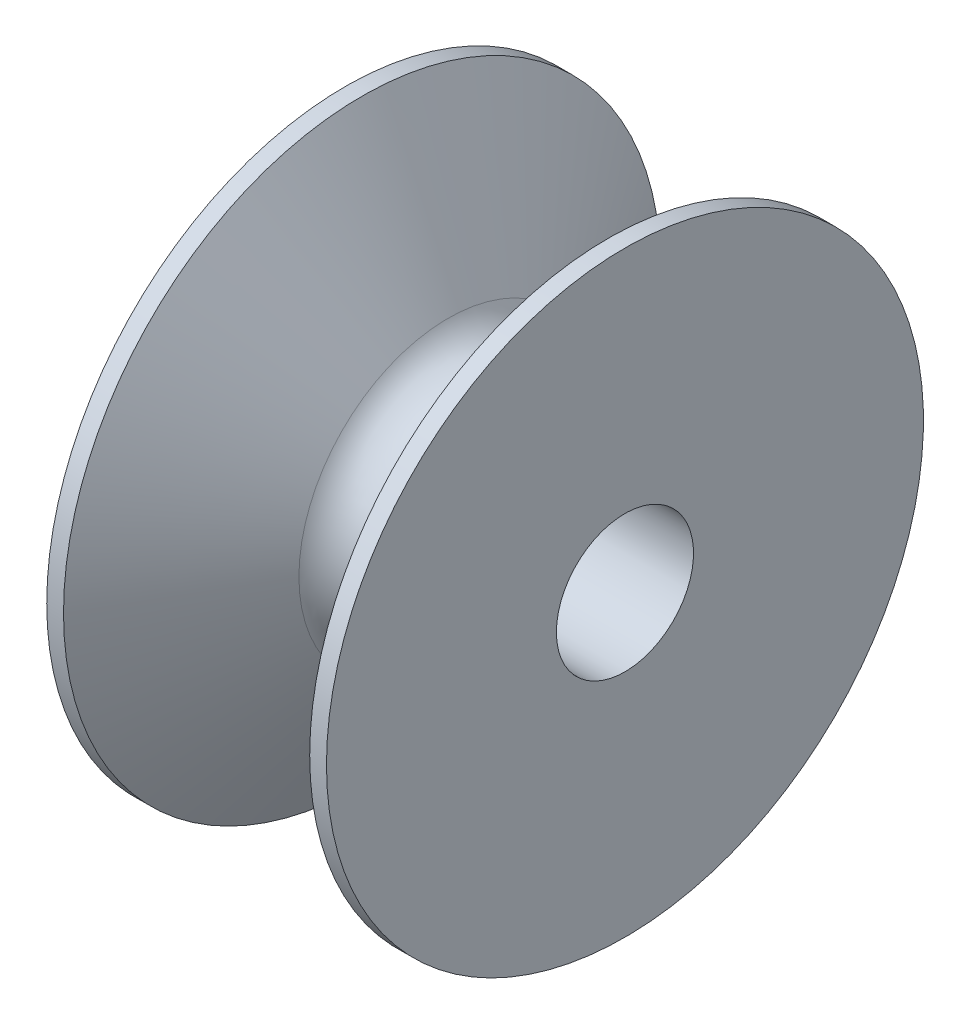
ISO-10303-21;
HEADER;
FILE_DESCRIPTION(('STEP AP214'),'2;1');
FILE_NAME('part.step','',(''),(''),'','','');
FILE_SCHEMA(('AUTOMOTIVE_DESIGN { 1 0 10303 214 1 1 1 1 }'));
ENDSEC;
DATA;
#1=APPLICATION_CONTEXT('core data for automotive mechanical design processes');
#2=APPLICATION_PROTOCOL_DEFINITION('international standard','automotive_design',2000,#1);
#3=PRODUCT_CONTEXT('',#1,'mechanical');
#4=PRODUCT('Part','Part','',(#3));
#5=PRODUCT_RELATED_PRODUCT_CATEGORY('part','',(#4));
#6=PRODUCT_DEFINITION_FORMATION('','',#4);
#7=PRODUCT_DEFINITION_CONTEXT('part definition',#1,'design');
#8=PRODUCT_DEFINITION('design','',#6,#7);
#9=PRODUCT_DEFINITION_SHAPE('','',#8);
#10=(LENGTH_UNIT() NAMED_UNIT(*) SI_UNIT(.MILLI.,.METRE.));
#11=(NAMED_UNIT(*) PLANE_ANGLE_UNIT() SI_UNIT($,.RADIAN.));
#12=(NAMED_UNIT(*) SI_UNIT($,.STERADIAN.) SOLID_ANGLE_UNIT());
#13=UNCERTAINTY_MEASURE_WITH_UNIT(LENGTH_MEASURE(1.E-05),#10,'distance_accuracy_value','');
#14=(GEOMETRIC_REPRESENTATION_CONTEXT(3) GLOBAL_UNCERTAINTY_ASSIGNED_CONTEXT((#13)) GLOBAL_UNIT_ASSIGNED_CONTEXT((#10,
#11,#12)) REPRESENTATION_CONTEXT('',''));
#15=CARTESIAN_POINT('',(0.,0.,0.));
#16=DIRECTION('',(0.,0.,1.));
#17=DIRECTION('',(1.,0.,0.));
#18=AXIS2_PLACEMENT_3D('',#15,#16,#17);
#19=CARTESIAN_POINT('',(0.,11.1125,0.));
#20=DIRECTION('',(1.,0.,0.));
#21=DIRECTION('',(0.,0.,-1.));
#22=AXIS2_PLACEMENT_3D('',#19,#20,#21);
#23=PLANE('',#22);
#24=CARTESIAN_POINT('',(0.,0.,0.));
#25=DIRECTION('',(-1.,0.,0.));
#26=DIRECTION('',(0.,0.,1.));
#27=AXIS2_PLACEMENT_3D('',#24,#25,#26);
#28=CIRCLE('',#27,2.5527);
#29=CARTESIAN_POINT('',(0.,0.,2.5527));
#30=VERTEX_POINT('',#29);
#31=EDGE_CURVE('E67',#30,#30,#28,.T.);
#32=ORIENTED_EDGE('',*,*,#31,.F.);
#33=EDGE_LOOP('',(#32));
#34=FACE_BOUND('',#33,.T.);
#35=CARTESIAN_POINT('',(0.,0.,0.));
#36=DIRECTION('',(-1.,0.,0.));
#37=DIRECTION('',(0.,0.,1.));
#38=AXIS2_PLACEMENT_3D('',#35,#36,#37);
#39=CIRCLE('',#38,11.1125);
#40=CARTESIAN_POINT('',(0.,0.,11.1125));
#41=VERTEX_POINT('',#40);
#42=EDGE_CURVE('E10',#41,#41,#39,.T.);
#43=ORIENTED_EDGE('',*,*,#42,.T.);
#44=EDGE_LOOP('',(#43));
#45=FACE_BOUND('',#44,.T.);
#46=ADVANCED_FACE('F39',(#34,#45),#23,.F.);
#47=CARTESIAN_POINT('',(0.,0.,0.));
#48=DIRECTION('',(-1.,0.,0.));
#49=DIRECTION('',(0.,0.,1.));
#50=AXIS2_PLACEMENT_3D('',#47,#48,#49);
#51=CYLINDRICAL_SURFACE('',#50,11.1125);
#52=ORIENTED_EDGE('',*,*,#42,.F.);
#53=EDGE_LOOP('',(#52));
#54=FACE_BOUND('',#53,.T.);
#55=CARTESIAN_POINT('',(0.624282238307362,0.,0.));
#56=DIRECTION('',(-1.,0.,0.));
#57=DIRECTION('',(0.,0.,1.));
#58=AXIS2_PLACEMENT_3D('',#55,#56,#57);
#59=CIRCLE('',#58,11.1125);
#60=CARTESIAN_POINT('',(0.624282238307362,0.,11.1125));
#61=VERTEX_POINT('',#60);
#62=EDGE_CURVE('E45',#61,#61,#59,.T.);
#63=ORIENTED_EDGE('',*,*,#62,.T.);
#64=EDGE_LOOP('',(#63));
#65=FACE_BOUND('',#64,.T.);
#66=ADVANCED_FACE('F74',(#54,#65),#51,.T.);
#67=CARTESIAN_POINT('',(3.8321846714922,0.,0.));
#68=DIRECTION('',(-1.,0.,0.));
#69=DIRECTION('',(0.,0.,1.));
#70=AXIS2_PLACEMENT_3D('',#67,#68,#69);
#71=CONICAL_SURFACE('',#70,5.55625,1.0471975511966);
#72=ORIENTED_EDGE('',*,*,#62,.F.);
#73=EDGE_LOOP('',(#72));
#74=FACE_BOUND('',#73,.T.);
#75=CARTESIAN_POINT('',(3.8321846714922,0.,0.));
#76=DIRECTION('',(-1.,0.,0.));
#77=DIRECTION('',(0.,0.,1.));
#78=AXIS2_PLACEMENT_3D('',#75,#76,#77);
#79=CIRCLE('',#78,5.55625);
#80=CARTESIAN_POINT('',(3.8321846714922,0.,5.55625));
#81=VERTEX_POINT('',#80);
#82=EDGE_CURVE('E49',#81,#81,#79,.T.);
#83=ORIENTED_EDGE('',*,*,#82,.T.);
#84=EDGE_LOOP('',(#83));
#85=FACE_BOUND('',#84,.T.);
#86=ADVANCED_FACE('F78',(#74,#85),#71,.T.);
#87=CARTESIAN_POINT('',(5.207,0.,0.));
#88=DIRECTION('',(-1.,0.,0.));
#89=DIRECTION('',(0.,0.,1.));
#90=AXIS2_PLACEMENT_3D('',#87,#88,#89);
#91=TOROIDAL_SURFACE('',#90,6.35,1.5875);
#92=ORIENTED_EDGE('',*,*,#82,.F.);
#93=EDGE_LOOP('',(#92));
#94=FACE_BOUND('',#93,.T.);
#95=CARTESIAN_POINT('',(6.5818153285078,0.,0.));
#96=DIRECTION('',(-1.,0.,0.));
#97=DIRECTION('',(0.,0.,1.));
#98=AXIS2_PLACEMENT_3D('',#95,#96,#97);
#99=CIRCLE('',#98,5.55625);
#100=CARTESIAN_POINT('',(6.5818153285078,0.,5.55625));
#101=VERTEX_POINT('',#100);
#102=EDGE_CURVE('E53',#101,#101,#99,.T.);
#103=ORIENTED_EDGE('',*,*,#102,.T.);
#104=EDGE_LOOP('',(#103));
#105=FACE_BOUND('',#104,.T.);
#106=ADVANCED_FACE('F83',(#94,#105),#91,.F.);
#107=CARTESIAN_POINT('',(9.78971776169264,0.,0.));
#108=DIRECTION('',(1.,0.,0.));
#109=DIRECTION('',(0.,0.,-1.));
#110=AXIS2_PLACEMENT_3D('',#107,#108,#109);
#111=CONICAL_SURFACE('',#110,11.1125,1.0471975511966);
#112=ORIENTED_EDGE('',*,*,#102,.F.);
#113=EDGE_LOOP('',(#112));
#114=FACE_BOUND('',#113,.T.);
#115=CARTESIAN_POINT('',(9.78971776169264,0.,0.));
#116=DIRECTION('',(-1.,0.,0.));
#117=DIRECTION('',(0.,0.,1.));
#118=AXIS2_PLACEMENT_3D('',#115,#116,#117);
#119=CIRCLE('',#118,11.1125);
#120=CARTESIAN_POINT('',(9.78971776169264,0.,11.1125));
#121=VERTEX_POINT('',#120);
#122=EDGE_CURVE('E58',#121,#121,#119,.T.);
#123=ORIENTED_EDGE('',*,*,#122,.T.);
#124=EDGE_LOOP('',(#123));
#125=FACE_BOUND('',#124,.T.);
#126=ADVANCED_FACE('F89',(#114,#125),#111,.T.);
#127=CARTESIAN_POINT('',(0.,0.,0.));
#128=DIRECTION('',(-1.,0.,0.));
#129=DIRECTION('',(0.,0.,1.));
#130=AXIS2_PLACEMENT_3D('',#127,#128,#129);
#131=CYLINDRICAL_SURFACE('',#130,11.1125);
#132=ORIENTED_EDGE('',*,*,#122,.F.);
#133=EDGE_LOOP('',(#132));
#134=FACE_BOUND('',#133,.T.);
#135=CARTESIAN_POINT('',(10.414,0.,0.));
#136=DIRECTION('',(-1.,0.,0.));
#137=DIRECTION('',(0.,0.,1.));
#138=AXIS2_PLACEMENT_3D('',#135,#136,#137);
#139=CIRCLE('',#138,11.1125);
#140=CARTESIAN_POINT('',(10.414,0.,11.1125));
#141=VERTEX_POINT('',#140);
#142=EDGE_CURVE('E61',#141,#141,#139,.T.);
#143=ORIENTED_EDGE('',*,*,#142,.T.);
#144=EDGE_LOOP('',(#143));
#145=FACE_BOUND('',#144,.T.);
#146=ADVANCED_FACE('F93',(#134,#145),#131,.T.);
#147=CARTESIAN_POINT('',(10.414,2.5527,0.));
#148=DIRECTION('',(-1.,0.,0.));
#149=DIRECTION('',(0.,0.,1.));
#150=AXIS2_PLACEMENT_3D('',#147,#148,#149);
#151=PLANE('',#150);
#152=ORIENTED_EDGE('',*,*,#142,.F.);
#153=EDGE_LOOP('',(#152));
#154=FACE_BOUND('',#153,.T.);
#155=CARTESIAN_POINT('',(10.414,0.,0.));
#156=DIRECTION('',(-1.,0.,0.));
#157=DIRECTION('',(0.,0.,1.));
#158=AXIS2_PLACEMENT_3D('',#155,#156,#157);
#159=CIRCLE('',#158,2.5527);
#160=CARTESIAN_POINT('',(10.414,0.,2.5527));
#161=VERTEX_POINT('',#160);
#162=EDGE_CURVE('E64',#161,#161,#159,.T.);
#163=ORIENTED_EDGE('',*,*,#162,.T.);
#164=EDGE_LOOP('',(#163));
#165=FACE_BOUND('',#164,.T.);
#166=ADVANCED_FACE('F97',(#154,#165),#151,.F.);
#167=CARTESIAN_POINT('',(0.,0.,0.));
#168=DIRECTION('',(-1.,0.,0.));
#169=DIRECTION('',(0.,0.,1.));
#170=AXIS2_PLACEMENT_3D('',#167,#168,#169);
#171=CYLINDRICAL_SURFACE('',#170,2.5527);
#172=ORIENTED_EDGE('',*,*,#162,.F.);
#173=EDGE_LOOP('',(#172));
#174=FACE_BOUND('',#173,.T.);
#175=ORIENTED_EDGE('',*,*,#31,.T.);
#176=EDGE_LOOP('',(#175));
#177=FACE_BOUND('',#176,.T.);
#178=ADVANCED_FACE('F71',(#174,#177),#171,.F.);
#179=CLOSED_SHELL('',(#46,#66,#86,#106,#126,#146,#166,#178));
#180=MANIFOLD_SOLID_BREP('B2',#179);
#181=ADVANCED_BREP_SHAPE_REPRESENTATION('',(#18,#180),#14);
#182=SHAPE_DEFINITION_REPRESENTATION(#9,#181);
ENDSEC;
END-ISO-10303-21;
